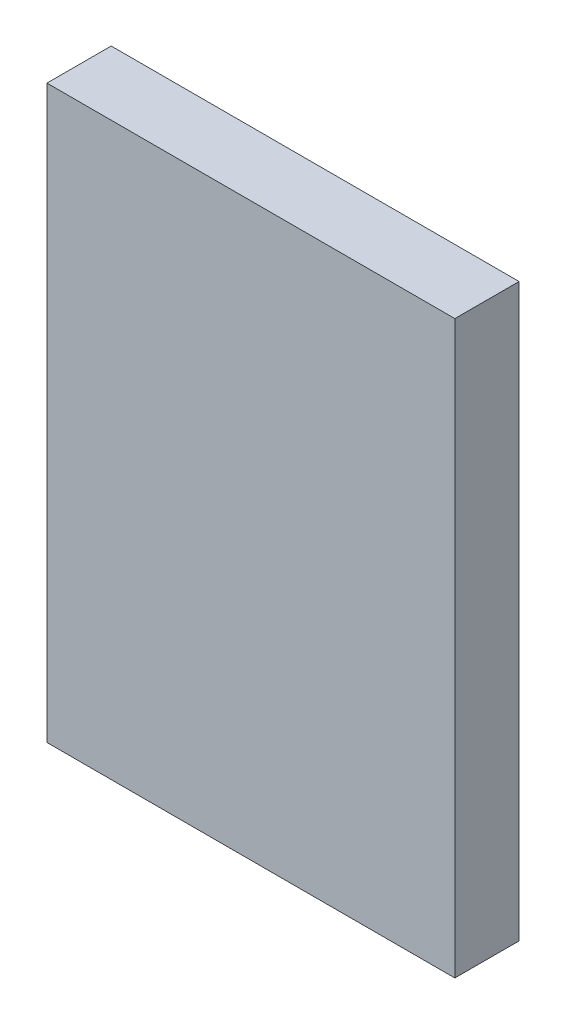
ISO-10303-21;
HEADER;
FILE_DESCRIPTION(('STEP AP214'),'2;1');
FILE_NAME('part.step','',(''),(''),'','','');
FILE_SCHEMA(('AUTOMOTIVE_DESIGN { 1 0 10303 214 1 1 1 1 }'));
ENDSEC;
DATA;
#1=APPLICATION_CONTEXT('core data for automotive mechanical design processes');
#2=APPLICATION_PROTOCOL_DEFINITION('international standard','automotive_design',2000,#1);
#3=PRODUCT_CONTEXT('',#1,'mechanical');
#4=PRODUCT('Part','Part','',(#3));
#5=PRODUCT_RELATED_PRODUCT_CATEGORY('part','',(#4));
#6=PRODUCT_DEFINITION_FORMATION('','',#4);
#7=PRODUCT_DEFINITION_CONTEXT('part definition',#1,'design');
#8=PRODUCT_DEFINITION('design','',#6,#7);
#9=PRODUCT_DEFINITION_SHAPE('','',#8);
#10=(LENGTH_UNIT() NAMED_UNIT(*) SI_UNIT(.MILLI.,.METRE.));
#11=(NAMED_UNIT(*) PLANE_ANGLE_UNIT() SI_UNIT($,.RADIAN.));
#12=(NAMED_UNIT(*) SI_UNIT($,.STERADIAN.) SOLID_ANGLE_UNIT());
#13=UNCERTAINTY_MEASURE_WITH_UNIT(LENGTH_MEASURE(1.E-05),#10,'distance_accuracy_value','');
#14=(GEOMETRIC_REPRESENTATION_CONTEXT(3) GLOBAL_UNCERTAINTY_ASSIGNED_CONTEXT((#13)) GLOBAL_UNIT_ASSIGNED_CONTEXT((#10,
#11,#12)) REPRESENTATION_CONTEXT('',''));
#15=CARTESIAN_POINT('',(0.,0.,0.));
#16=DIRECTION('',(0.,0.,1.));
#17=DIRECTION('',(1.,0.,0.));
#18=AXIS2_PLACEMENT_3D('',#15,#16,#17);
#19=CARTESIAN_POINT('',(-3.175,-4.445,1.));
#20=DIRECTION('',(1.,0.,0.));
#21=DIRECTION('',(0.,0.,-1.));
#22=AXIS2_PLACEMENT_3D('',#19,#20,#21);
#23=PLANE('',#22);
#24=DIRECTION('',(0.,-1.,0.));
#25=VECTOR('',#24,1.);
#26=CARTESIAN_POINT('',(-3.175,-4.445,0.));
#27=LINE('',#26,#25);
#28=CARTESIAN_POINT('',(-3.175,4.445,0.));
#29=VERTEX_POINT('',#28);
#30=CARTESIAN_POINT('',(-3.175,-4.445,0.));
#31=VERTEX_POINT('',#30);
#32=EDGE_CURVE('E95',#29,#31,#27,.T.);
#33=ORIENTED_EDGE('',*,*,#32,.T.);
#34=DIRECTION('',(0.,0.,-1.));
#35=VECTOR('',#34,1.);
#36=CARTESIAN_POINT('',(-3.175,-4.445,1.));
#37=LINE('',#36,#35);
#38=CARTESIAN_POINT('',(-3.175,-4.445,1.));
#39=VERTEX_POINT('',#38);
#40=EDGE_CURVE('E11',#39,#31,#37,.T.);
#41=ORIENTED_EDGE('',*,*,#40,.F.);
#42=DIRECTION('',(0.,-1.,0.));
#43=VECTOR('',#42,1.);
#44=CARTESIAN_POINT('',(-3.175,-4.445,1.));
#45=LINE('',#44,#43);
#46=CARTESIAN_POINT('',(-3.175,4.445,1.));
#47=VERTEX_POINT('',#46);
#48=EDGE_CURVE('E83',#47,#39,#45,.T.);
#49=ORIENTED_EDGE('',*,*,#48,.F.);
#50=DIRECTION('',(0.,0.,-1.));
#51=VECTOR('',#50,1.);
#52=CARTESIAN_POINT('',(-3.175,4.445,1.));
#53=LINE('',#52,#51);
#54=EDGE_CURVE('E91',#47,#29,#53,.T.);
#55=ORIENTED_EDGE('',*,*,#54,.T.);
#56=EDGE_LOOP('',(#33,#41,#49,#55));
#57=FACE_BOUND('',#56,.T.);
#58=ADVANCED_FACE('F32',(#57),#23,.F.);
#59=CARTESIAN_POINT('',(3.175,-4.445,1.));
#60=DIRECTION('',(0.,1.,0.));
#61=DIRECTION('',(0.,0.,1.));
#62=AXIS2_PLACEMENT_3D('',#59,#60,#61);
#63=PLANE('',#62);
#64=DIRECTION('',(1.,0.,0.));
#65=VECTOR('',#64,1.);
#66=CARTESIAN_POINT('',(3.175,-4.445,0.));
#67=LINE('',#66,#65);
#68=CARTESIAN_POINT('',(3.175,-4.445,0.));
#69=VERTEX_POINT('',#68);
#70=EDGE_CURVE('E87',#31,#69,#67,.T.);
#71=ORIENTED_EDGE('',*,*,#70,.T.);
#72=DIRECTION('',(0.,0.,-1.));
#73=VECTOR('',#72,1.);
#74=CARTESIAN_POINT('',(3.175,-4.445,1.));
#75=LINE('',#74,#73);
#76=CARTESIAN_POINT('',(3.175,-4.445,1.));
#77=VERTEX_POINT('',#76);
#78=EDGE_CURVE('E40',#77,#69,#75,.T.);
#79=ORIENTED_EDGE('',*,*,#78,.F.);
#80=DIRECTION('',(1.,0.,0.));
#81=VECTOR('',#80,1.);
#82=CARTESIAN_POINT('',(3.175,-4.445,1.));
#83=LINE('',#82,#81);
#84=EDGE_CURVE('E78',#39,#77,#83,.T.);
#85=ORIENTED_EDGE('',*,*,#84,.F.);
#86=ORIENTED_EDGE('',*,*,#40,.T.);
#87=EDGE_LOOP('',(#71,#79,#85,#86));
#88=FACE_BOUND('',#87,.T.);
#89=ADVANCED_FACE('F86',(#88),#63,.F.);
#90=CARTESIAN_POINT('',(3.175,4.445,1.));
#91=DIRECTION('',(-1.,0.,0.));
#92=DIRECTION('',(0.,0.,1.));
#93=AXIS2_PLACEMENT_3D('',#90,#91,#92);
#94=PLANE('',#93);
#95=DIRECTION('',(0.,1.,0.));
#96=VECTOR('',#95,1.);
#97=CARTESIAN_POINT('',(3.175,4.445,0.));
#98=LINE('',#97,#96);
#99=CARTESIAN_POINT('',(3.175,4.445,0.));
#100=VERTEX_POINT('',#99);
#101=EDGE_CURVE('E65',#69,#100,#98,.T.);
#102=ORIENTED_EDGE('',*,*,#101,.T.);
#103=DIRECTION('',(0.,0.,-1.));
#104=VECTOR('',#103,1.);
#105=CARTESIAN_POINT('',(3.175,4.445,1.));
#106=LINE('',#105,#104);
#107=CARTESIAN_POINT('',(3.175,4.445,1.));
#108=VERTEX_POINT('',#107);
#109=EDGE_CURVE('E88',#108,#100,#106,.T.);
#110=ORIENTED_EDGE('',*,*,#109,.F.);
#111=DIRECTION('',(0.,1.,0.));
#112=VECTOR('',#111,1.);
#113=CARTESIAN_POINT('',(3.175,4.445,1.));
#114=LINE('',#113,#112);
#115=EDGE_CURVE('E81',#77,#108,#114,.T.);
#116=ORIENTED_EDGE('',*,*,#115,.F.);
#117=ORIENTED_EDGE('',*,*,#78,.T.);
#118=EDGE_LOOP('',(#102,#110,#116,#117));
#119=FACE_BOUND('',#118,.T.);
#120=ADVANCED_FACE('F89',(#119),#94,.F.);
#121=CARTESIAN_POINT('',(-3.175,4.445,1.));
#122=DIRECTION('',(0.,-1.,0.));
#123=DIRECTION('',(0.,0.,-1.));
#124=AXIS2_PLACEMENT_3D('',#121,#122,#123);
#125=PLANE('',#124);
#126=DIRECTION('',(-1.,0.,0.));
#127=VECTOR('',#126,1.);
#128=CARTESIAN_POINT('',(-3.175,4.445,0.));
#129=LINE('',#128,#127);
#130=EDGE_CURVE('E71',#100,#29,#129,.T.);
#131=ORIENTED_EDGE('',*,*,#130,.T.);
#132=ORIENTED_EDGE('',*,*,#54,.F.);
#133=DIRECTION('',(-1.,0.,0.));
#134=VECTOR('',#133,1.);
#135=CARTESIAN_POINT('',(-3.175,4.445,1.));
#136=LINE('',#135,#134);
#137=EDGE_CURVE('E48',#108,#47,#136,.T.);
#138=ORIENTED_EDGE('',*,*,#137,.F.);
#139=ORIENTED_EDGE('',*,*,#109,.T.);
#140=EDGE_LOOP('',(#131,#132,#138,#139));
#141=FACE_BOUND('',#140,.T.);
#142=ADVANCED_FACE('F102',(#141),#125,.F.);
#143=CARTESIAN_POINT('',(0.,0.,1.));
#144=DIRECTION('',(0.,0.,-1.));
#145=DIRECTION('',(-1.,0.,0.));
#146=AXIS2_PLACEMENT_3D('',#143,#144,#145);
#147=PLANE('',#146);
#148=ORIENTED_EDGE('',*,*,#48,.T.);
#149=ORIENTED_EDGE('',*,*,#84,.T.);
#150=ORIENTED_EDGE('',*,*,#115,.T.);
#151=ORIENTED_EDGE('',*,*,#137,.T.);
#152=EDGE_LOOP('',(#148,#149,#150,#151));
#153=FACE_BOUND('',#152,.T.);
#154=ADVANCED_FACE('F79',(#153),#147,.F.);
#155=CARTESIAN_POINT('',(0.,0.,0.));
#156=DIRECTION('',(0.,0.,-1.));
#157=DIRECTION('',(-1.,0.,0.));
#158=AXIS2_PLACEMENT_3D('',#155,#156,#157);
#159=PLANE('',#158);
#160=ORIENTED_EDGE('',*,*,#32,.F.);
#161=ORIENTED_EDGE('',*,*,#130,.F.);
#162=ORIENTED_EDGE('',*,*,#101,.F.);
#163=ORIENTED_EDGE('',*,*,#70,.F.);
#164=EDGE_LOOP('',(#160,#161,#162,#163));
#165=FACE_BOUND('',#164,.T.);
#166=ADVANCED_FACE('F105',(#165),#159,.T.);
#167=CLOSED_SHELL('',(#58,#89,#120,#142,#154,#166));
#168=MANIFOLD_SOLID_BREP('B2',#167);
#169=ADVANCED_BREP_SHAPE_REPRESENTATION('',(#18,#168),#14);
#170=SHAPE_DEFINITION_REPRESENTATION(#9,#169);
ENDSEC;
END-ISO-10303-21;
